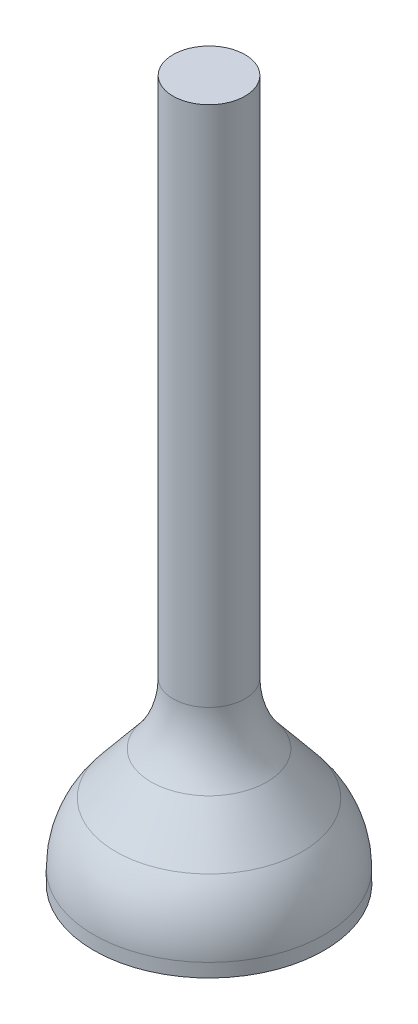
ISO-10303-21;
HEADER;
FILE_DESCRIPTION(('STEP AP214'),'2;1');
FILE_NAME('part.step','',(''),(''),'','','');
FILE_SCHEMA(('AUTOMOTIVE_DESIGN { 1 0 10303 214 1 1 1 1 }'));
ENDSEC;
DATA;
#1=APPLICATION_CONTEXT('core data for automotive mechanical design processes');
#2=APPLICATION_PROTOCOL_DEFINITION('international standard','automotive_design',2000,#1);
#3=PRODUCT_CONTEXT('',#1,'mechanical');
#4=PRODUCT('Part','Part','',(#3));
#5=PRODUCT_RELATED_PRODUCT_CATEGORY('part','',(#4));
#6=PRODUCT_DEFINITION_FORMATION('','',#4);
#7=PRODUCT_DEFINITION_CONTEXT('part definition',#1,'design');
#8=PRODUCT_DEFINITION('design','',#6,#7);
#9=PRODUCT_DEFINITION_SHAPE('','',#8);
#10=(LENGTH_UNIT() NAMED_UNIT(*) SI_UNIT(.MILLI.,.METRE.));
#11=(NAMED_UNIT(*) PLANE_ANGLE_UNIT() SI_UNIT($,.RADIAN.));
#12=(NAMED_UNIT(*) SI_UNIT($,.STERADIAN.) SOLID_ANGLE_UNIT());
#13=UNCERTAINTY_MEASURE_WITH_UNIT(LENGTH_MEASURE(1.E-05),#10,'distance_accuracy_value','');
#14=(GEOMETRIC_REPRESENTATION_CONTEXT(3) GLOBAL_UNCERTAINTY_ASSIGNED_CONTEXT((#13)) GLOBAL_UNIT_ASSIGNED_CONTEXT((#10,
#11,#12)) REPRESENTATION_CONTEXT('',''));
#15=CARTESIAN_POINT('',(0.,0.,0.));
#16=DIRECTION('',(0.,0.,1.));
#17=DIRECTION('',(1.,0.,0.));
#18=AXIS2_PLACEMENT_3D('',#15,#16,#17);
#19=CARTESIAN_POINT('',(0.,1.27,0.));
#20=DIRECTION('',(0.,-1.,0.));
#21=DIRECTION('',(0.,0.,-1.));
#22=AXIS2_PLACEMENT_3D('',#19,#20,#21);
#23=CYLINDRICAL_SURFACE('',#22,3.048);
#24=CARTESIAN_POINT('',(0.,0.357480473617091,0.));
#25=DIRECTION('',(0.,-1.,0.));
#26=DIRECTION('',(0.,0.,-1.));
#27=AXIS2_PLACEMENT_3D('',#24,#25,#26);
#28=CIRCLE('',#27,3.048);
#29=CARTESIAN_POINT('',(0.,0.357480473617091,-3.048));
#30=VERTEX_POINT('',#29);
#31=EDGE_CURVE('E42',#30,#30,#28,.T.);
#32=ORIENTED_EDGE('',*,*,#31,.T.);
#33=EDGE_LOOP('',(#32));
#34=FACE_BOUND('',#33,.T.);
#35=CARTESIAN_POINT('',(0.,0.,0.));
#36=DIRECTION('',(0.,1.,0.));
#37=DIRECTION('',(0.,0.,1.));
#38=AXIS2_PLACEMENT_3D('',#35,#36,#37);
#39=CIRCLE('',#38,3.048);
#40=CARTESIAN_POINT('',(0.,0.,3.048));
#41=VERTEX_POINT('',#40);
#42=EDGE_CURVE('E55',#41,#41,#39,.T.);
#43=ORIENTED_EDGE('',*,*,#42,.T.);
#44=EDGE_LOOP('',(#43));
#45=FACE_BOUND('',#44,.T.);
#46=ADVANCED_FACE('F35',(#34,#45),#23,.T.);
#47=CARTESIAN_POINT('',(0.,0.,0.));
#48=DIRECTION('',(0.,1.,0.));
#49=DIRECTION('',(0.,0.,1.));
#50=AXIS2_PLACEMENT_3D('',#47,#48,#49);
#51=PLANE('',#50);
#52=ORIENTED_EDGE('',*,*,#42,.F.);
#53=EDGE_LOOP('',(#52));
#54=FACE_BOUND('',#53,.T.);
#55=ADVANCED_FACE('F74',(#54),#51,.F.);
#56=CARTESIAN_POINT('',(0.,3.81,0.));
#57=DIRECTION('',(0.,-1.,0.));
#58=DIRECTION('',(0.,0.,-1.));
#59=AXIS2_PLACEMENT_3D('',#56,#57,#58);
#60=CONICAL_SURFACE('',#59,0.9525,0.689800044733608);
#61=CARTESIAN_POINT('',(0.,1.97389317879782,0.));
#62=DIRECTION('',(0.,-1.,0.));
#63=DIRECTION('',(0.,0.,-1.));
#64=AXIS2_PLACEMENT_3D('',#61,#62,#63);
#65=CIRCLE('',#64,2.4672881274918);
#66=CARTESIAN_POINT('',(0.,1.97389317879782,-2.4672881274918));
#67=VERTEX_POINT('',#66);
#68=EDGE_CURVE('E46',#67,#67,#65,.F.);
#69=ORIENTED_EDGE('',*,*,#68,.T.);
#70=EDGE_LOOP('',(#69));
#71=FACE_BOUND('',#70,.T.);
#72=CARTESIAN_POINT('',(0.,3.10610682120218,0.));
#73=DIRECTION('',(0.,1.,0.));
#74=DIRECTION('',(0.,0.,1.));
#75=AXIS2_PLACEMENT_3D('',#72,#73,#74);
#76=CIRCLE('',#75,1.5332118725082);
#77=CARTESIAN_POINT('',(0.,3.10610682120218,1.5332118725082));
#78=VERTEX_POINT('',#77);
#79=EDGE_CURVE('E50',#78,#78,#76,.F.);
#80=ORIENTED_EDGE('',*,*,#79,.T.);
#81=EDGE_LOOP('',(#80));
#82=FACE_BOUND('',#81,.T.);
#83=ADVANCED_FACE('F66',(#71,#82),#60,.T.);
#84=CARTESIAN_POINT('',(0.,18.542,0.));
#85=DIRECTION('',(0.,-1.,0.));
#86=DIRECTION('',(0.,0.,-1.));
#87=AXIS2_PLACEMENT_3D('',#84,#85,#86);
#88=CYLINDRICAL_SURFACE('',#87,0.9525);
#89=CARTESIAN_POINT('',(0.,4.72251952638291,0.));
#90=DIRECTION('',(0.,1.,0.));
#91=DIRECTION('',(0.,0.,1.));
#92=AXIS2_PLACEMENT_3D('',#89,#90,#91);
#93=CIRCLE('',#92,0.9525);
#94=CARTESIAN_POINT('',(0.,4.72251952638291,0.9525));
#95=VERTEX_POINT('',#94);
#96=EDGE_CURVE('E11',#95,#95,#93,.T.);
#97=ORIENTED_EDGE('',*,*,#96,.T.);
#98=EDGE_LOOP('',(#97));
#99=FACE_BOUND('',#98,.T.);
#100=CARTESIAN_POINT('',(0.,18.542,0.));
#101=DIRECTION('',(0.,1.,0.));
#102=DIRECTION('',(0.,0.,1.));
#103=AXIS2_PLACEMENT_3D('',#100,#101,#102);
#104=CIRCLE('',#103,0.9525);
#105=CARTESIAN_POINT('',(0.,18.542,0.9525));
#106=VERTEX_POINT('',#105);
#107=EDGE_CURVE('E58',#106,#106,#104,.T.);
#108=ORIENTED_EDGE('',*,*,#107,.F.);
#109=EDGE_LOOP('',(#108));
#110=FACE_BOUND('',#109,.T.);
#111=ADVANCED_FACE('F64',(#99,#110),#88,.T.);
#112=CARTESIAN_POINT('',(0.,18.542,0.));
#113=DIRECTION('',(0.,1.,0.));
#114=DIRECTION('',(0.,0.,1.));
#115=AXIS2_PLACEMENT_3D('',#112,#113,#114);
#116=PLANE('',#115);
#117=ORIENTED_EDGE('',*,*,#107,.T.);
#118=EDGE_LOOP('',(#117));
#119=FACE_BOUND('',#118,.T.);
#120=ADVANCED_FACE('F62',(#119),#116,.T.);
#121=CARTESIAN_POINT('',(0.,0.357480473617091,0.));
#122=DIRECTION('',(0.,-1.,0.));
#123=DIRECTION('',(0.,0.,-1.));
#124=AXIS2_PLACEMENT_3D('',#121,#122,#123);
#125=DEGENERATE_TOROIDAL_SURFACE('',#124,0.508,2.54,.T.);
#126=ORIENTED_EDGE('',*,*,#31,.F.);
#127=EDGE_LOOP('',(#126));
#128=FACE_BOUND('',#127,.T.);
#129=ORIENTED_EDGE('',*,*,#68,.F.);
#130=EDGE_LOOP('',(#129));
#131=FACE_BOUND('',#130,.T.);
#132=ADVANCED_FACE('F72',(#128,#131),#125,.T.);
#133=CARTESIAN_POINT('',(0.,4.72251952638291,0.));
#134=DIRECTION('',(0.,1.,0.));
#135=DIRECTION('',(0.,0.,1.));
#136=AXIS2_PLACEMENT_3D('',#133,#134,#135);
#137=TOROIDAL_SURFACE('',#136,3.4925,2.54);
#138=ORIENTED_EDGE('',*,*,#79,.F.);
#139=EDGE_LOOP('',(#138));
#140=FACE_BOUND('',#139,.T.);
#141=ORIENTED_EDGE('',*,*,#96,.F.);
#142=EDGE_LOOP('',(#141));
#143=FACE_BOUND('',#142,.T.);
#144=ADVANCED_FACE('F37',(#140,#143),#137,.F.);
#145=CLOSED_SHELL('',(#46,#55,#83,#111,#120,#132,#144));
#146=MANIFOLD_SOLID_BREP('B2',#145);
#147=ADVANCED_BREP_SHAPE_REPRESENTATION('',(#18,#146),#14);
#148=SHAPE_DEFINITION_REPRESENTATION(#9,#147);
ENDSEC;
END-ISO-10303-21;
